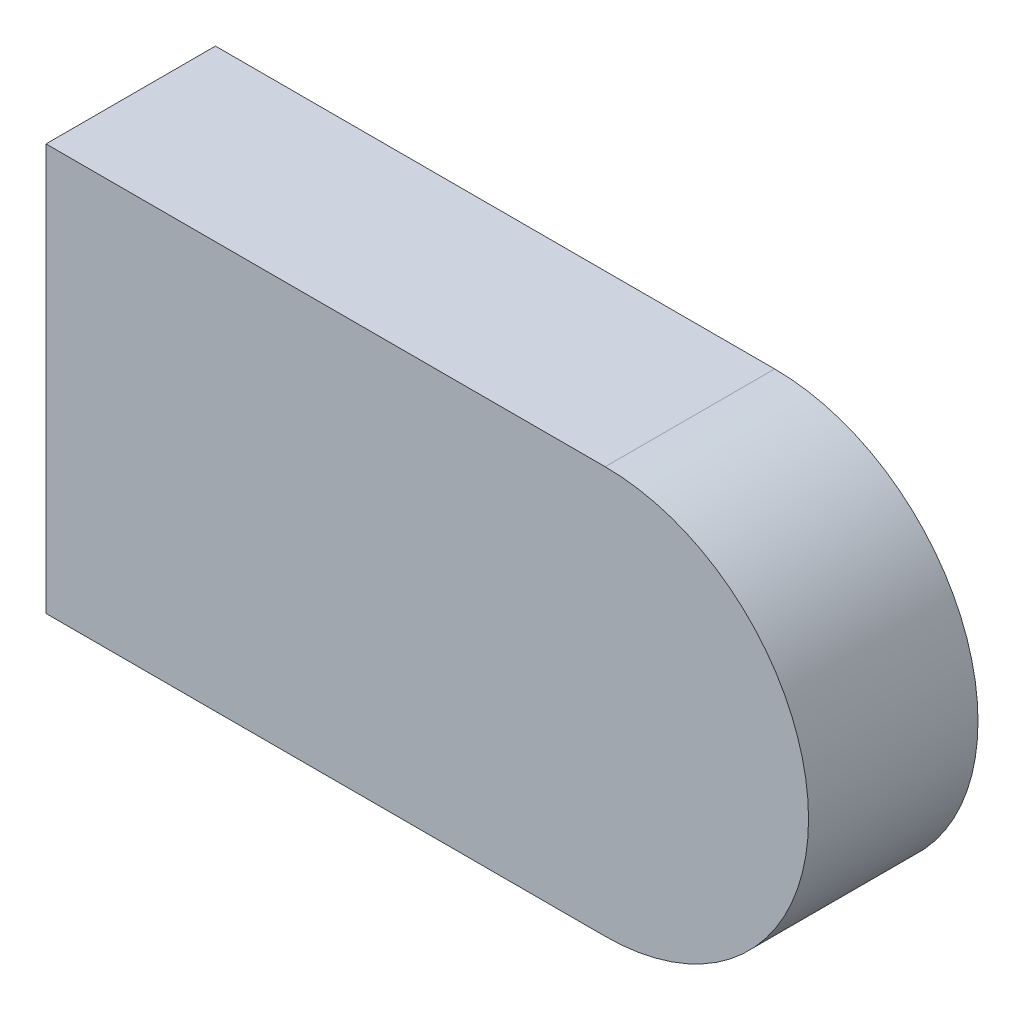
ISO-10303-21;
HEADER;
FILE_DESCRIPTION(('STEP AP214'),'2;1');
FILE_NAME('part.step','',(''),(''),'','','');
FILE_SCHEMA(('AUTOMOTIVE_DESIGN { 1 0 10303 214 1 1 1 1 }'));
ENDSEC;
DATA;
#1=APPLICATION_CONTEXT('core data for automotive mechanical design processes');
#2=APPLICATION_PROTOCOL_DEFINITION('international standard','automotive_design',2000,#1);
#3=PRODUCT_CONTEXT('',#1,'mechanical');
#4=PRODUCT('Part','Part','',(#3));
#5=PRODUCT_RELATED_PRODUCT_CATEGORY('part','',(#4));
#6=PRODUCT_DEFINITION_FORMATION('','',#4);
#7=PRODUCT_DEFINITION_CONTEXT('part definition',#1,'design');
#8=PRODUCT_DEFINITION('design','',#6,#7);
#9=PRODUCT_DEFINITION_SHAPE('','',#8);
#10=(LENGTH_UNIT() NAMED_UNIT(*) SI_UNIT(.MILLI.,.METRE.));
#11=(NAMED_UNIT(*) PLANE_ANGLE_UNIT() SI_UNIT($,.RADIAN.));
#12=(NAMED_UNIT(*) SI_UNIT($,.STERADIAN.) SOLID_ANGLE_UNIT());
#13=UNCERTAINTY_MEASURE_WITH_UNIT(LENGTH_MEASURE(1.E-05),#10,'distance_accuracy_value','');
#14=(GEOMETRIC_REPRESENTATION_CONTEXT(3) GLOBAL_UNCERTAINTY_ASSIGNED_CONTEXT((#13)) GLOBAL_UNIT_ASSIGNED_CONTEXT((#10,
#11,#12)) REPRESENTATION_CONTEXT('',''));
#15=CARTESIAN_POINT('',(0.,0.,0.));
#16=DIRECTION('',(0.,0.,1.));
#17=DIRECTION('',(1.,0.,0.));
#18=AXIS2_PLACEMENT_3D('',#15,#16,#17);
#19=CARTESIAN_POINT('',(-4.05,1.13,0.));
#20=DIRECTION('',(0.,1.,0.));
#21=DIRECTION('',(1.,0.,0.));
#22=AXIS2_PLACEMENT_3D('',#19,#20,#21);
#23=PLANE('',#22);
#24=DIRECTION('',(1.,0.,0.));
#25=VECTOR('',#24,1.);
#26=CARTESIAN_POINT('',(-4.05,1.13,0.));
#27=LINE('',#26,#25);
#28=CARTESIAN_POINT('',(-4.05,1.13,0.));
#29=VERTEX_POINT('',#28);
#30=CARTESIAN_POINT('',(-3.72,1.13,0.));
#31=VERTEX_POINT('',#30);
#32=EDGE_CURVE('E11',#29,#31,#27,.T.);
#33=ORIENTED_EDGE('',*,*,#32,.T.);
#34=DIRECTION('',(0.,0.,1.));
#35=VECTOR('',#34,1.);
#36=CARTESIAN_POINT('',(-3.72,1.13,0.));
#37=LINE('',#36,#35);
#38=CARTESIAN_POINT('',(-3.72,1.13,0.1));
#39=VERTEX_POINT('',#38);
#40=EDGE_CURVE('E24',#31,#39,#37,.T.);
#41=ORIENTED_EDGE('',*,*,#40,.T.);
#42=DIRECTION('',(1.,0.,0.));
#43=VECTOR('',#42,1.);
#44=CARTESIAN_POINT('',(-4.05,1.13,0.1));
#45=LINE('',#44,#43);
#46=CARTESIAN_POINT('',(-4.05,1.13,0.1));
#47=VERTEX_POINT('',#46);
#48=EDGE_CURVE('E88',#47,#39,#45,.T.);
#49=ORIENTED_EDGE('',*,*,#48,.F.);
#50=DIRECTION('',(0.,0.,1.));
#51=VECTOR('',#50,1.);
#52=CARTESIAN_POINT('',(-4.05,1.13,0.));
#53=LINE('',#52,#51);
#54=EDGE_CURVE('E36',#29,#47,#53,.T.);
#55=ORIENTED_EDGE('',*,*,#54,.F.);
#56=EDGE_LOOP('',(#33,#41,#49,#55));
#57=FACE_BOUND('',#56,.T.);
#58=ADVANCED_FACE('F17',(#57),#23,.F.);
#59=CARTESIAN_POINT('',(-3.72,1.25,0.));
#60=DIRECTION('',(0.,0.,-1.));
#61=DIRECTION('',(1.,0.,0.));
#62=AXIS2_PLACEMENT_3D('',#59,#60,#61);
#63=CYLINDRICAL_SURFACE('',#62,0.12);
#64=CARTESIAN_POINT('',(-3.72,1.25,0.));
#65=DIRECTION('',(0.,0.,1.));
#66=DIRECTION('',(1.,0.,0.));
#67=AXIS2_PLACEMENT_3D('',#64,#65,#66);
#68=CIRCLE('',#67,0.12);
#69=CARTESIAN_POINT('',(-3.72,1.37,0.));
#70=VERTEX_POINT('',#69);
#71=EDGE_CURVE('E85',#31,#70,#68,.T.);
#72=ORIENTED_EDGE('',*,*,#71,.T.);
#73=DIRECTION('',(0.,0.,1.));
#74=VECTOR('',#73,1.);
#75=CARTESIAN_POINT('',(-3.72,1.37,0.));
#76=LINE('',#75,#74);
#77=CARTESIAN_POINT('',(-3.72,1.37,0.1));
#78=VERTEX_POINT('',#77);
#79=EDGE_CURVE('E73',#70,#78,#76,.T.);
#80=ORIENTED_EDGE('',*,*,#79,.T.);
#81=CARTESIAN_POINT('',(-3.72,1.25,0.1));
#82=DIRECTION('',(0.,0.,1.));
#83=DIRECTION('',(1.,0.,0.));
#84=AXIS2_PLACEMENT_3D('',#81,#82,#83);
#85=CIRCLE('',#84,0.12);
#86=EDGE_CURVE('E66',#39,#78,#85,.T.);
#87=ORIENTED_EDGE('',*,*,#86,.F.);
#88=ORIENTED_EDGE('',*,*,#40,.F.);
#89=EDGE_LOOP('',(#72,#80,#87,#88));
#90=FACE_BOUND('',#89,.T.);
#91=ADVANCED_FACE('F89',(#90),#63,.T.);
#92=CARTESIAN_POINT('',(-4.05,1.37,0.));
#93=DIRECTION('',(0.,1.,0.));
#94=DIRECTION('',(1.,0.,0.));
#95=AXIS2_PLACEMENT_3D('',#92,#93,#94);
#96=PLANE('',#95);
#97=DIRECTION('',(0.,0.,1.));
#98=VECTOR('',#97,1.);
#99=CARTESIAN_POINT('',(-4.05,1.37,0.));
#100=LINE('',#99,#98);
#101=CARTESIAN_POINT('',(-4.05,1.37,0.));
#102=VERTEX_POINT('',#101);
#103=CARTESIAN_POINT('',(-4.05,1.37,0.1));
#104=VERTEX_POINT('',#103);
#105=EDGE_CURVE('E56',#102,#104,#100,.T.);
#106=ORIENTED_EDGE('',*,*,#105,.T.);
#107=DIRECTION('',(1.,0.,0.));
#108=VECTOR('',#107,1.);
#109=CARTESIAN_POINT('',(-4.05,1.37,0.1));
#110=LINE('',#109,#108);
#111=EDGE_CURVE('E67',#104,#78,#110,.T.);
#112=ORIENTED_EDGE('',*,*,#111,.T.);
#113=ORIENTED_EDGE('',*,*,#79,.F.);
#114=DIRECTION('',(1.,0.,0.));
#115=VECTOR('',#114,1.);
#116=CARTESIAN_POINT('',(-4.05,1.37,0.));
#117=LINE('',#116,#115);
#118=EDGE_CURVE('E71',#102,#70,#117,.T.);
#119=ORIENTED_EDGE('',*,*,#118,.F.);
#120=EDGE_LOOP('',(#106,#112,#113,#119));
#121=FACE_BOUND('',#120,.T.);
#122=ADVANCED_FACE('F72',(#121),#96,.T.);
#123=CARTESIAN_POINT('',(-4.05,1.13,0.));
#124=DIRECTION('',(-1.,0.,0.));
#125=DIRECTION('',(0.,1.,0.));
#126=AXIS2_PLACEMENT_3D('',#123,#124,#125);
#127=PLANE('',#126);
#128=ORIENTED_EDGE('',*,*,#54,.T.);
#129=DIRECTION('',(0.,1.,0.));
#130=VECTOR('',#129,1.);
#131=CARTESIAN_POINT('',(-4.05,1.13,0.1));
#132=LINE('',#131,#130);
#133=EDGE_CURVE('E62',#47,#104,#132,.T.);
#134=ORIENTED_EDGE('',*,*,#133,.T.);
#135=ORIENTED_EDGE('',*,*,#105,.F.);
#136=DIRECTION('',(0.,1.,0.));
#137=VECTOR('',#136,1.);
#138=CARTESIAN_POINT('',(-4.05,1.13,0.));
#139=LINE('',#138,#137);
#140=EDGE_CURVE('E60',#29,#102,#139,.T.);
#141=ORIENTED_EDGE('',*,*,#140,.F.);
#142=EDGE_LOOP('',(#128,#134,#135,#141));
#143=FACE_BOUND('',#142,.T.);
#144=ADVANCED_FACE('F58',(#143),#127,.T.);
#145=CARTESIAN_POINT('',(-3.849490847913,1.25,0.));
#146=DIRECTION('',(0.,0.,1.));
#147=DIRECTION('',(1.,0.,0.));
#148=AXIS2_PLACEMENT_3D('',#145,#146,#147);
#149=PLANE('',#148);
#150=ORIENTED_EDGE('',*,*,#140,.T.);
#151=ORIENTED_EDGE('',*,*,#118,.T.);
#152=ORIENTED_EDGE('',*,*,#71,.F.);
#153=ORIENTED_EDGE('',*,*,#32,.F.);
#154=EDGE_LOOP('',(#150,#151,#152,#153));
#155=FACE_BOUND('',#154,.T.);
#156=ADVANCED_FACE('F77',(#155),#149,.F.);
#157=CARTESIAN_POINT('',(-3.849490847913,1.25,0.1));
#158=DIRECTION('',(0.,0.,1.));
#159=DIRECTION('',(1.,0.,0.));
#160=AXIS2_PLACEMENT_3D('',#157,#158,#159);
#161=PLANE('',#160);
#162=ORIENTED_EDGE('',*,*,#48,.T.);
#163=ORIENTED_EDGE('',*,*,#86,.T.);
#164=ORIENTED_EDGE('',*,*,#111,.F.);
#165=ORIENTED_EDGE('',*,*,#133,.F.);
#166=EDGE_LOOP('',(#162,#163,#164,#165));
#167=FACE_BOUND('',#166,.T.);
#168=ADVANCED_FACE('F91',(#167),#161,.T.);
#169=CLOSED_SHELL('',(#58,#91,#122,#144,#156,#168));
#170=MANIFOLD_SOLID_BREP('B1',#169);
#171=ADVANCED_BREP_SHAPE_REPRESENTATION('',(#18,#170),#14);
#172=SHAPE_DEFINITION_REPRESENTATION(#9,#171);
ENDSEC;
END-ISO-10303-21;
